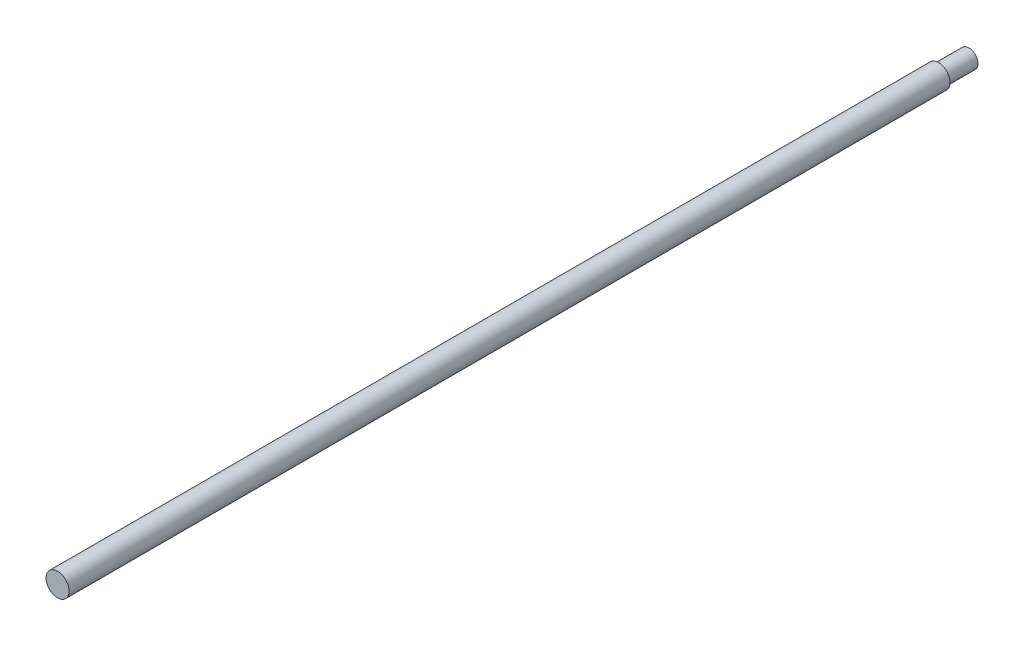
ISO-10303-21;
HEADER;
FILE_DESCRIPTION(('STEP AP214'),'2;1');
FILE_NAME('part.step','',(''),(''),'','','');
FILE_SCHEMA(('AUTOMOTIVE_DESIGN { 1 0 10303 214 1 1 1 1 }'));
ENDSEC;
DATA;
#1=APPLICATION_CONTEXT('core data for automotive mechanical design processes');
#2=APPLICATION_PROTOCOL_DEFINITION('international standard','automotive_design',2000,#1);
#3=PRODUCT_CONTEXT('',#1,'mechanical');
#4=PRODUCT('Part','Part','',(#3));
#5=PRODUCT_RELATED_PRODUCT_CATEGORY('part','',(#4));
#6=PRODUCT_DEFINITION_FORMATION('','',#4);
#7=PRODUCT_DEFINITION_CONTEXT('part definition',#1,'design');
#8=PRODUCT_DEFINITION('design','',#6,#7);
#9=PRODUCT_DEFINITION_SHAPE('','',#8);
#10=(LENGTH_UNIT() NAMED_UNIT(*) SI_UNIT(.MILLI.,.METRE.));
#11=(NAMED_UNIT(*) PLANE_ANGLE_UNIT() SI_UNIT($,.RADIAN.));
#12=(NAMED_UNIT(*) SI_UNIT($,.STERADIAN.) SOLID_ANGLE_UNIT());
#13=UNCERTAINTY_MEASURE_WITH_UNIT(LENGTH_MEASURE(1.E-05),#10,'distance_accuracy_value','');
#14=(GEOMETRIC_REPRESENTATION_CONTEXT(3) GLOBAL_UNCERTAINTY_ASSIGNED_CONTEXT((#13)) GLOBAL_UNIT_ASSIGNED_CONTEXT((#10,
#11,#12)) REPRESENTATION_CONTEXT('',''));
#15=CARTESIAN_POINT('',(0.,0.,0.));
#16=DIRECTION('',(0.,0.,1.));
#17=DIRECTION('',(1.,0.,0.));
#18=AXIS2_PLACEMENT_3D('',#15,#16,#17);
#19=CARTESIAN_POINT('',(0.,0.,300.));
#20=DIRECTION('',(0.,0.,-1.));
#21=DIRECTION('',(-1.,0.,0.));
#22=AXIS2_PLACEMENT_3D('',#19,#20,#21);
#23=CYLINDRICAL_SURFACE('',#22,3.8);
#24=CARTESIAN_POINT('',(0.,0.,300.));
#25=DIRECTION('',(0.,0.,1.));
#26=DIRECTION('',(1.,0.,0.));
#27=AXIS2_PLACEMENT_3D('',#24,#25,#26);
#28=CIRCLE('',#27,3.8);
#29=CARTESIAN_POINT('',(3.8,0.,300.));
#30=VERTEX_POINT('',#29);
#31=EDGE_CURVE('E11',#30,#30,#28,.T.);
#32=ORIENTED_EDGE('',*,*,#31,.F.);
#33=EDGE_LOOP('',(#32));
#34=FACE_BOUND('',#33,.T.);
#35=CARTESIAN_POINT('',(0.,0.,10.));
#36=DIRECTION('',(0.,0.,-1.));
#37=DIRECTION('',(-1.,0.,0.));
#38=AXIS2_PLACEMENT_3D('',#35,#36,#37);
#39=CIRCLE('',#38,3.8);
#40=CARTESIAN_POINT('',(-3.8,0.,10.));
#41=VERTEX_POINT('',#40);
#42=EDGE_CURVE('E37',#41,#41,#39,.T.);
#43=ORIENTED_EDGE('',*,*,#42,.F.);
#44=EDGE_LOOP('',(#43));
#45=FACE_BOUND('',#44,.T.);
#46=ADVANCED_FACE('F34',(#34,#45),#23,.T.);
#47=CARTESIAN_POINT('',(0.,0.,300.));
#48=DIRECTION('',(0.,0.,1.));
#49=DIRECTION('',(1.,0.,0.));
#50=AXIS2_PLACEMENT_3D('',#47,#48,#49);
#51=PLANE('',#50);
#52=ORIENTED_EDGE('',*,*,#31,.T.);
#53=EDGE_LOOP('',(#52));
#54=FACE_BOUND('',#53,.T.);
#55=ADVANCED_FACE('F58',(#54),#51,.T.);
#56=CARTESIAN_POINT('',(0.,0.,10.));
#57=DIRECTION('',(0.,0.,-1.));
#58=DIRECTION('',(-1.,0.,0.));
#59=AXIS2_PLACEMENT_3D('',#56,#57,#58);
#60=PLANE('',#59);
#61=CARTESIAN_POINT('',(0.,0.,10.));
#62=DIRECTION('',(0.,0.,-1.));
#63=DIRECTION('',(-1.,0.,0.));
#64=AXIS2_PLACEMENT_3D('',#61,#62,#63);
#65=CIRCLE('',#64,3.);
#66=CARTESIAN_POINT('',(-3.,0.,10.));
#67=VERTEX_POINT('',#66);
#68=EDGE_CURVE('E44',#67,#67,#65,.T.);
#69=ORIENTED_EDGE('',*,*,#68,.F.);
#70=EDGE_LOOP('',(#69));
#71=FACE_BOUND('',#70,.T.);
#72=ORIENTED_EDGE('',*,*,#42,.T.);
#73=EDGE_LOOP('',(#72));
#74=FACE_BOUND('',#73,.T.);
#75=ADVANCED_FACE('F55',(#71,#74),#60,.T.);
#76=CARTESIAN_POINT('',(0.,0.,10.));
#77=DIRECTION('',(0.,0.,-1.));
#78=DIRECTION('',(-1.,0.,0.));
#79=AXIS2_PLACEMENT_3D('',#76,#77,#78);
#80=CYLINDRICAL_SURFACE('',#79,3.);
#81=ORIENTED_EDGE('',*,*,#68,.T.);
#82=EDGE_LOOP('',(#81));
#83=FACE_BOUND('',#82,.T.);
#84=CARTESIAN_POINT('',(0.,0.,0.));
#85=DIRECTION('',(0.,0.,-1.));
#86=DIRECTION('',(-1.,0.,0.));
#87=AXIS2_PLACEMENT_3D('',#84,#85,#86);
#88=CIRCLE('',#87,3.);
#89=CARTESIAN_POINT('',(-3.,0.,0.));
#90=VERTEX_POINT('',#89);
#91=EDGE_CURVE('E46',#90,#90,#88,.T.);
#92=ORIENTED_EDGE('',*,*,#91,.F.);
#93=EDGE_LOOP('',(#92));
#94=FACE_BOUND('',#93,.T.);
#95=ADVANCED_FACE('F52',(#83,#94),#80,.T.);
#96=CARTESIAN_POINT('',(0.,0.,0.));
#97=DIRECTION('',(0.,0.,1.));
#98=DIRECTION('',(1.,0.,0.));
#99=AXIS2_PLACEMENT_3D('',#96,#97,#98);
#100=PLANE('',#99);
#101=ORIENTED_EDGE('',*,*,#91,.T.);
#102=EDGE_LOOP('',(#101));
#103=FACE_BOUND('',#102,.T.);
#104=ADVANCED_FACE('F71',(#103),#100,.F.);
#105=CLOSED_SHELL('',(#46,#55,#75,#95,#104));
#106=MANIFOLD_SOLID_BREP('B2',#105);
#107=ADVANCED_BREP_SHAPE_REPRESENTATION('',(#18,#106),#14);
#108=SHAPE_DEFINITION_REPRESENTATION(#9,#107);
ENDSEC;
END-ISO-10303-21;
